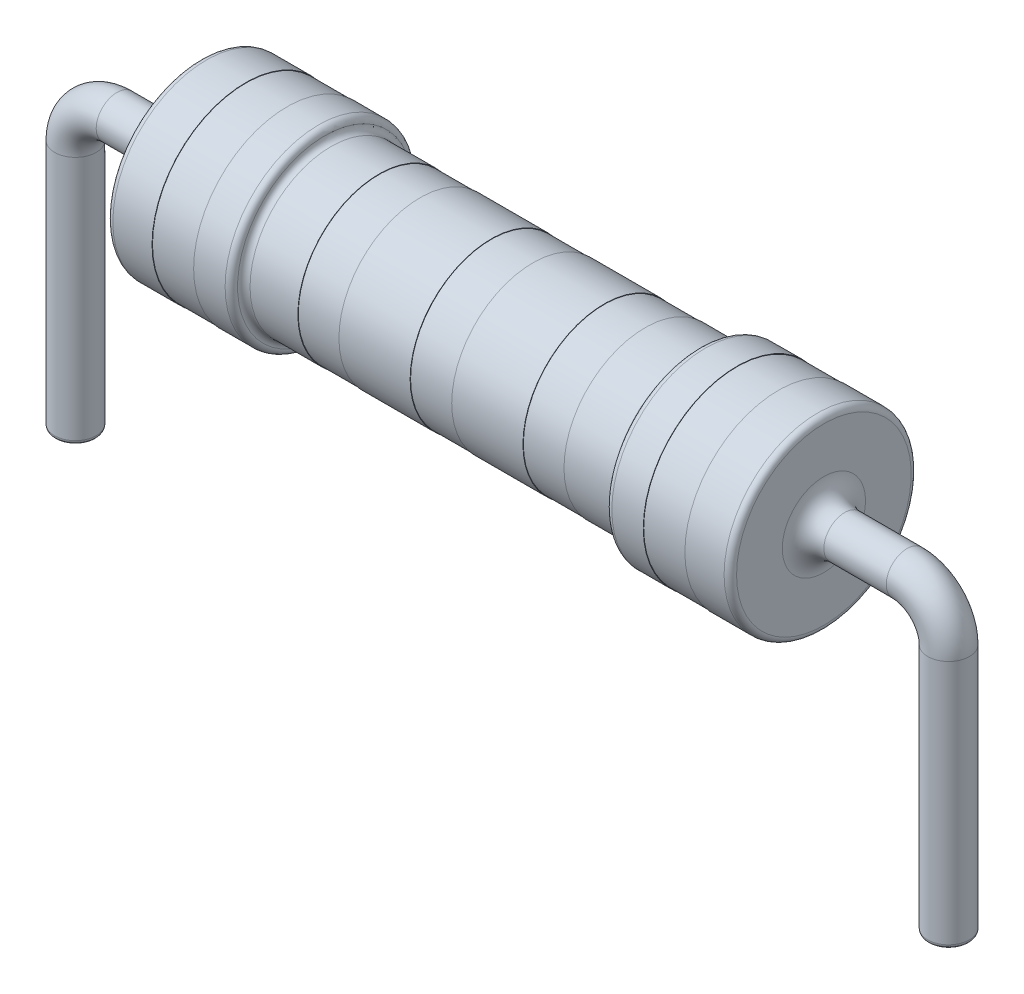
ISO-10303-21;
HEADER;
FILE_DESCRIPTION(('STEP AP214'),'2;1');
FILE_NAME('part.step','',(''),(''),'','','');
FILE_SCHEMA(('AUTOMOTIVE_DESIGN { 1 0 10303 214 1 1 1 1 }'));
ENDSEC;
DATA;
#1=APPLICATION_CONTEXT('core data for automotive mechanical design processes');
#2=APPLICATION_PROTOCOL_DEFINITION('international standard','automotive_design',2000,#1);
#3=PRODUCT_CONTEXT('',#1,'mechanical');
#4=PRODUCT('Part','Part','',(#3));
#5=PRODUCT_RELATED_PRODUCT_CATEGORY('part','',(#4));
#6=PRODUCT_DEFINITION_FORMATION('','',#4);
#7=PRODUCT_DEFINITION_CONTEXT('part definition',#1,'design');
#8=PRODUCT_DEFINITION('design','',#6,#7);
#9=PRODUCT_DEFINITION_SHAPE('','',#8);
#10=(LENGTH_UNIT() NAMED_UNIT(*) SI_UNIT(.MILLI.,.METRE.));
#11=(NAMED_UNIT(*) PLANE_ANGLE_UNIT() SI_UNIT($,.RADIAN.));
#12=(NAMED_UNIT(*) SI_UNIT($,.STERADIAN.) SOLID_ANGLE_UNIT());
#13=UNCERTAINTY_MEASURE_WITH_UNIT(LENGTH_MEASURE(1.E-05),#10,'distance_accuracy_value','');
#14=(GEOMETRIC_REPRESENTATION_CONTEXT(3) GLOBAL_UNCERTAINTY_ASSIGNED_CONTEXT((#13)) GLOBAL_UNIT_ASSIGNED_CONTEXT((#10,
#11,#12)) REPRESENTATION_CONTEXT('',''));
#15=CARTESIAN_POINT('',(0.,0.,0.));
#16=DIRECTION('',(0.,0.,1.));
#17=DIRECTION('',(1.,0.,0.));
#18=AXIS2_PLACEMENT_3D('',#15,#16,#17);
#19=CARTESIAN_POINT('',(7.5,-1.89738903908675,0.));
#20=DIRECTION('',(-1.,0.,0.));
#21=DIRECTION('',(0.,0.,1.));
#22=AXIS2_PLACEMENT_3D('',#19,#20,#21);
#23=PLANE('',#22);
#24=CARTESIAN_POINT('',(7.5,-1.89738903908675,0.));
#25=DIRECTION('',(-1.,0.,0.));
#26=DIRECTION('',(0.,0.,1.));
#27=AXIS2_PLACEMENT_3D('',#24,#25,#26);
#28=CIRCLE('',#27,1.);
#29=CARTESIAN_POINT('',(7.5,-1.89738903908675,1.));
#30=VERTEX_POINT('',#29);
#31=EDGE_CURVE('E10',#30,#30,#28,.T.);
#32=ORIENTED_EDGE('',*,*,#31,.T.);
#33=EDGE_LOOP('',(#32));
#34=FACE_BOUND('',#33,.T.);
#35=CARTESIAN_POINT('',(7.5,-1.89738903908675,0.));
#36=DIRECTION('',(-1.,0.,0.));
#37=DIRECTION('',(0.,0.,1.));
#38=AXIS2_PLACEMENT_3D('',#35,#36,#37);
#39=CIRCLE('',#38,2.1);
#40=CARTESIAN_POINT('',(7.5,-1.89738903908675,2.1));
#41=VERTEX_POINT('',#40);
#42=EDGE_CURVE('E60',#41,#41,#39,.F.);
#43=ORIENTED_EDGE('',*,*,#42,.T.);
#44=EDGE_LOOP('',(#43));
#45=FACE_BOUND('',#44,.T.);
#46=ADVANCED_FACE('F34',(#34,#45),#23,.F.);
#47=CARTESIAN_POINT('',(-7.5,-1.89738903908675,0.));
#48=DIRECTION('',(-1.,0.,0.));
#49=DIRECTION('',(0.,0.,1.));
#50=AXIS2_PLACEMENT_3D('',#47,#48,#49);
#51=CYLINDRICAL_SURFACE('',#50,2.25);
#52=CARTESIAN_POINT('',(-7.35,-1.89738903908675,0.));
#53=DIRECTION('',(-1.,0.,0.));
#54=DIRECTION('',(0.,0.,1.));
#55=AXIS2_PLACEMENT_3D('',#52,#53,#54);
#56=CIRCLE('',#55,2.25);
#57=CARTESIAN_POINT('',(-7.35,-1.89738903908675,2.25));
#58=VERTEX_POINT('',#57);
#59=EDGE_CURVE('E66',#58,#58,#56,.F.);
#60=ORIENTED_EDGE('',*,*,#59,.T.);
#61=EDGE_LOOP('',(#60));
#62=FACE_BOUND('',#61,.T.);
#63=CARTESIAN_POINT('',(-6.40684922175231,-1.89738903908675,0.));
#64=DIRECTION('',(-1.,0.,0.));
#65=DIRECTION('',(0.,0.,1.));
#66=AXIS2_PLACEMENT_3D('',#63,#64,#65);
#67=CIRCLE('',#66,2.25);
#68=CARTESIAN_POINT('',(-6.40684922175231,-1.89738903908675,2.25));
#69=VERTEX_POINT('',#68);
#70=EDGE_CURVE('E96',#69,#69,#67,.T.);
#71=ORIENTED_EDGE('',*,*,#70,.T.);
#72=EDGE_LOOP('',(#71));
#73=FACE_BOUND('',#72,.T.);
#74=ADVANCED_FACE('F189',(#62,#73),#51,.T.);
#75=CARTESIAN_POINT('',(-6.40684922175231,-4.14738903908675,0.));
#76=DIRECTION('',(1.,0.,0.));
#77=DIRECTION('',(0.,0.,-1.));
#78=AXIS2_PLACEMENT_3D('',#75,#76,#77);
#79=PLANE('',#78);
#80=CARTESIAN_POINT('',(-6.40684922175231,-1.89738903908675,0.));
#81=DIRECTION('',(-1.,0.,0.));
#82=DIRECTION('',(0.,0.,1.));
#83=AXIS2_PLACEMENT_3D('',#80,#81,#82);
#84=CIRCLE('',#83,2.24);
#85=CARTESIAN_POINT('',(-6.40684922175231,-1.89738903908675,2.24));
#86=VERTEX_POINT('',#85);
#87=EDGE_CURVE('E99',#86,#86,#84,.T.);
#88=ORIENTED_EDGE('',*,*,#87,.T.);
#89=EDGE_LOOP('',(#88));
#90=FACE_BOUND('',#89,.T.);
#91=ORIENTED_EDGE('',*,*,#70,.F.);
#92=EDGE_LOOP('',(#91));
#93=FACE_BOUND('',#92,.T.);
#94=ADVANCED_FACE('F194',(#90,#93),#79,.T.);
#95=CARTESIAN_POINT('',(-7.5,-1.89738903908675,0.));
#96=DIRECTION('',(-1.,0.,0.));
#97=DIRECTION('',(0.,0.,1.));
#98=AXIS2_PLACEMENT_3D('',#95,#96,#97);
#99=CYLINDRICAL_SURFACE('',#98,2.24);
#100=CARTESIAN_POINT('',(-5.40684922175231,-1.89738903908675,0.));
#101=DIRECTION('',(-1.,0.,0.));
#102=DIRECTION('',(0.,0.,1.));
#103=AXIS2_PLACEMENT_3D('',#100,#101,#102);
#104=CIRCLE('',#103,2.24);
#105=CARTESIAN_POINT('',(-5.40684922175231,-1.89738903908675,2.24));
#106=VERTEX_POINT('',#105);
#107=EDGE_CURVE('E102',#106,#106,#104,.T.);
#108=ORIENTED_EDGE('',*,*,#107,.T.);
#109=EDGE_LOOP('',(#108));
#110=FACE_BOUND('',#109,.T.);
#111=ORIENTED_EDGE('',*,*,#87,.F.);
#112=EDGE_LOOP('',(#111));
#113=FACE_BOUND('',#112,.T.);
#114=ADVANCED_FACE('F281',(#110,#113),#99,.T.);
#115=CARTESIAN_POINT('',(-5.40684922175231,-4.13738903908675,0.));
#116=DIRECTION('',(-1.,0.,0.));
#117=DIRECTION('',(0.,0.,1.));
#118=AXIS2_PLACEMENT_3D('',#115,#116,#117);
#119=PLANE('',#118);
#120=CARTESIAN_POINT('',(-5.40684922175231,-1.89738903908675,0.));
#121=DIRECTION('',(-1.,0.,0.));
#122=DIRECTION('',(0.,0.,1.));
#123=AXIS2_PLACEMENT_3D('',#120,#121,#122);
#124=CIRCLE('',#123,2.24999999999999);
#125=CARTESIAN_POINT('',(-5.40684922175231,-1.89738903908675,2.24999999999999));
#126=VERTEX_POINT('',#125);
#127=EDGE_CURVE('E105',#126,#126,#124,.T.);
#128=ORIENTED_EDGE('',*,*,#127,.T.);
#129=EDGE_LOOP('',(#128));
#130=FACE_BOUND('',#129,.T.);
#131=ORIENTED_EDGE('',*,*,#107,.F.);
#132=EDGE_LOOP('',(#131));
#133=FACE_BOUND('',#132,.T.);
#134=ADVANCED_FACE('F277',(#130,#133),#119,.T.);
#135=CARTESIAN_POINT('',(-7.5,-1.89738903908675,0.));
#136=DIRECTION('',(-1.,0.,0.));
#137=DIRECTION('',(0.,0.,1.));
#138=AXIS2_PLACEMENT_3D('',#135,#136,#137);
#139=CYLINDRICAL_SURFACE('',#138,2.24999999999999);
#140=CARTESIAN_POINT('',(-4.65,-1.89738903908675,0.));
#141=DIRECTION('',(1.,0.,0.));
#142=DIRECTION('',(0.,0.,-1.));
#143=AXIS2_PLACEMENT_3D('',#140,#141,#142);
#144=CIRCLE('',#143,2.24999999999999);
#145=CARTESIAN_POINT('',(-4.65,-1.89738903908675,-2.24999999999999));
#146=VERTEX_POINT('',#145);
#147=EDGE_CURVE('E75',#146,#146,#144,.F.);
#148=ORIENTED_EDGE('',*,*,#147,.T.);
#149=EDGE_LOOP('',(#148));
#150=FACE_BOUND('',#149,.T.);
#151=ORIENTED_EDGE('',*,*,#127,.F.);
#152=EDGE_LOOP('',(#151));
#153=FACE_BOUND('',#152,.T.);
#154=ADVANCED_FACE('F273',(#150,#153),#139,.T.);
#155=CARTESIAN_POINT('',(-7.5,-1.89738903908675,0.));
#156=DIRECTION('',(-1.,0.,0.));
#157=DIRECTION('',(0.,0.,1.));
#158=AXIS2_PLACEMENT_3D('',#155,#156,#157);
#159=CYLINDRICAL_SURFACE('',#158,1.95);
#160=CARTESIAN_POINT('',(-4.35,-1.89738903908675,0.));
#161=DIRECTION('',(1.,0.,0.));
#162=DIRECTION('',(0.,0.,-1.));
#163=AXIS2_PLACEMENT_3D('',#160,#161,#162);
#164=CIRCLE('',#163,1.95);
#165=CARTESIAN_POINT('',(-4.35,-1.89738903908675,-1.95));
#166=VERTEX_POINT('',#165);
#167=EDGE_CURVE('E54',#166,#166,#164,.T.);
#168=ORIENTED_EDGE('',*,*,#167,.T.);
#169=EDGE_LOOP('',(#168));
#170=FACE_BOUND('',#169,.T.);
#171=CARTESIAN_POINT('',(-3.2,-1.89738903908675,0.));
#172=DIRECTION('',(-1.,0.,0.));
#173=DIRECTION('',(0.,0.,1.));
#174=AXIS2_PLACEMENT_3D('',#171,#172,#173);
#175=CIRCLE('',#174,1.95);
#176=CARTESIAN_POINT('',(-3.2,-1.89738903908675,1.95));
#177=VERTEX_POINT('',#176);
#178=EDGE_CURVE('E108',#177,#177,#175,.T.);
#179=ORIENTED_EDGE('',*,*,#178,.T.);
#180=EDGE_LOOP('',(#179));
#181=FACE_BOUND('',#180,.T.);
#182=ADVANCED_FACE('F269',(#170,#181),#159,.T.);
#183=CARTESIAN_POINT('',(-3.2,-3.84738903908675,0.));
#184=DIRECTION('',(1.,0.,0.));
#185=DIRECTION('',(0.,0.,-1.));
#186=AXIS2_PLACEMENT_3D('',#183,#184,#185);
#187=PLANE('',#186);
#188=CARTESIAN_POINT('',(-3.2,-1.89738903908675,0.));
#189=DIRECTION('',(-1.,0.,0.));
#190=DIRECTION('',(0.,0.,1.));
#191=AXIS2_PLACEMENT_3D('',#188,#189,#190);
#192=CIRCLE('',#191,1.94);
#193=CARTESIAN_POINT('',(-3.2,-1.89738903908675,1.94));
#194=VERTEX_POINT('',#193);
#195=EDGE_CURVE('E111',#194,#194,#192,.T.);
#196=ORIENTED_EDGE('',*,*,#195,.T.);
#197=EDGE_LOOP('',(#196));
#198=FACE_BOUND('',#197,.T.);
#199=ORIENTED_EDGE('',*,*,#178,.F.);
#200=EDGE_LOOP('',(#199));
#201=FACE_BOUND('',#200,.T.);
#202=ADVANCED_FACE('F265',(#198,#201),#187,.T.);
#203=CARTESIAN_POINT('',(-7.5,-1.89738903908675,0.));
#204=DIRECTION('',(-1.,0.,0.));
#205=DIRECTION('',(0.,0.,1.));
#206=AXIS2_PLACEMENT_3D('',#203,#204,#205);
#207=CYLINDRICAL_SURFACE('',#206,1.94);
#208=CARTESIAN_POINT('',(-2.21268048519063,-1.89738903908675,0.));
#209=DIRECTION('',(-1.,0.,0.));
#210=DIRECTION('',(0.,0.,1.));
#211=AXIS2_PLACEMENT_3D('',#208,#209,#210);
#212=CIRCLE('',#211,1.94);
#213=CARTESIAN_POINT('',(-2.21268048519063,-1.89738903908675,1.94));
#214=VERTEX_POINT('',#213);
#215=EDGE_CURVE('E114',#214,#214,#212,.T.);
#216=ORIENTED_EDGE('',*,*,#215,.T.);
#217=EDGE_LOOP('',(#216));
#218=FACE_BOUND('',#217,.T.);
#219=ORIENTED_EDGE('',*,*,#195,.F.);
#220=EDGE_LOOP('',(#219));
#221=FACE_BOUND('',#220,.T.);
#222=ADVANCED_FACE('F261',(#218,#221),#207,.T.);
#223=CARTESIAN_POINT('',(-2.21268048519063,-3.83738903908675,0.));
#224=DIRECTION('',(-1.,0.,0.));
#225=DIRECTION('',(0.,0.,1.));
#226=AXIS2_PLACEMENT_3D('',#223,#224,#225);
#227=PLANE('',#226);
#228=CARTESIAN_POINT('',(-2.21268048519063,-1.89738903908675,0.));
#229=DIRECTION('',(-1.,0.,0.));
#230=DIRECTION('',(0.,0.,1.));
#231=AXIS2_PLACEMENT_3D('',#228,#229,#230);
#232=CIRCLE('',#231,1.95);
#233=CARTESIAN_POINT('',(-2.21268048519063,-1.89738903908675,1.95));
#234=VERTEX_POINT('',#233);
#235=EDGE_CURVE('E117',#234,#234,#232,.T.);
#236=ORIENTED_EDGE('',*,*,#235,.T.);
#237=EDGE_LOOP('',(#236));
#238=FACE_BOUND('',#237,.T.);
#239=ORIENTED_EDGE('',*,*,#215,.F.);
#240=EDGE_LOOP('',(#239));
#241=FACE_BOUND('',#240,.T.);
#242=ADVANCED_FACE('F257',(#238,#241),#227,.T.);
#243=CARTESIAN_POINT('',(-7.5,-1.89738903908675,0.));
#244=DIRECTION('',(-1.,0.,0.));
#245=DIRECTION('',(0.,0.,1.));
#246=AXIS2_PLACEMENT_3D('',#243,#244,#245);
#247=CYLINDRICAL_SURFACE('',#246,1.95);
#248=CARTESIAN_POINT('',(-0.5,-1.89738903908675,0.));
#249=DIRECTION('',(-1.,0.,0.));
#250=DIRECTION('',(0.,0.,1.));
#251=AXIS2_PLACEMENT_3D('',#248,#249,#250);
#252=CIRCLE('',#251,1.95);
#253=CARTESIAN_POINT('',(-0.5,-1.89738903908675,1.95));
#254=VERTEX_POINT('',#253);
#255=EDGE_CURVE('E120',#254,#254,#252,.T.);
#256=ORIENTED_EDGE('',*,*,#255,.T.);
#257=EDGE_LOOP('',(#256));
#258=FACE_BOUND('',#257,.T.);
#259=ORIENTED_EDGE('',*,*,#235,.F.);
#260=EDGE_LOOP('',(#259));
#261=FACE_BOUND('',#260,.T.);
#262=ADVANCED_FACE('F253',(#258,#261),#247,.T.);
#263=CARTESIAN_POINT('',(-0.5,-3.84738903908675,0.));
#264=DIRECTION('',(1.,0.,0.));
#265=DIRECTION('',(0.,0.,-1.));
#266=AXIS2_PLACEMENT_3D('',#263,#264,#265);
#267=PLANE('',#266);
#268=CARTESIAN_POINT('',(-0.5,-1.89738903908675,0.));
#269=DIRECTION('',(-1.,0.,0.));
#270=DIRECTION('',(0.,0.,1.));
#271=AXIS2_PLACEMENT_3D('',#268,#269,#270);
#272=CIRCLE('',#271,1.94);
#273=CARTESIAN_POINT('',(-0.5,-1.89738903908675,1.94));
#274=VERTEX_POINT('',#273);
#275=EDGE_CURVE('E123',#274,#274,#272,.T.);
#276=ORIENTED_EDGE('',*,*,#275,.T.);
#277=EDGE_LOOP('',(#276));
#278=FACE_BOUND('',#277,.T.);
#279=ORIENTED_EDGE('',*,*,#255,.F.);
#280=EDGE_LOOP('',(#279));
#281=FACE_BOUND('',#280,.T.);
#282=ADVANCED_FACE('F249',(#278,#281),#267,.T.);
#283=CARTESIAN_POINT('',(-7.5,-1.89738903908675,0.));
#284=DIRECTION('',(-1.,0.,0.));
#285=DIRECTION('',(0.,0.,1.));
#286=AXIS2_PLACEMENT_3D('',#283,#284,#285);
#287=CYLINDRICAL_SURFACE('',#286,1.94);
#288=ORIENTED_EDGE('',*,*,#275,.F.);
#289=EDGE_LOOP('',(#288));
#290=FACE_BOUND('',#289,.T.);
#291=CARTESIAN_POINT('',(0.5,-1.89738903908675,0.));
#292=DIRECTION('',(-1.,0.,0.));
#293=DIRECTION('',(0.,0.,1.));
#294=AXIS2_PLACEMENT_3D('',#291,#292,#293);
#295=CIRCLE('',#294,1.94);
#296=CARTESIAN_POINT('',(0.5,-1.89738903908675,1.94));
#297=VERTEX_POINT('',#296);
#298=EDGE_CURVE('E126',#297,#297,#295,.T.);
#299=ORIENTED_EDGE('',*,*,#298,.T.);
#300=EDGE_LOOP('',(#299));
#301=FACE_BOUND('',#300,.T.);
#302=ADVANCED_FACE('F245',(#290,#301),#287,.T.);
#303=CARTESIAN_POINT('',(0.5,-3.84738903908675,0.));
#304=DIRECTION('',(1.,0.,0.));
#305=DIRECTION('',(0.,0.,-1.));
#306=AXIS2_PLACEMENT_3D('',#303,#304,#305);
#307=PLANE('',#306);
#308=ORIENTED_EDGE('',*,*,#298,.F.);
#309=EDGE_LOOP('',(#308));
#310=FACE_BOUND('',#309,.T.);
#311=CARTESIAN_POINT('',(0.5,-1.89738903908675,0.));
#312=DIRECTION('',(-1.,0.,0.));
#313=DIRECTION('',(0.,0.,1.));
#314=AXIS2_PLACEMENT_3D('',#311,#312,#313);
#315=CIRCLE('',#314,1.95);
#316=CARTESIAN_POINT('',(0.5,-1.89738903908675,1.95));
#317=VERTEX_POINT('',#316);
#318=EDGE_CURVE('E129',#317,#317,#315,.T.);
#319=ORIENTED_EDGE('',*,*,#318,.T.);
#320=EDGE_LOOP('',(#319));
#321=FACE_BOUND('',#320,.T.);
#322=ADVANCED_FACE('F241',(#310,#321),#307,.F.);
#323=CARTESIAN_POINT('',(-7.5,-1.89738903908675,0.));
#324=DIRECTION('',(-1.,0.,0.));
#325=DIRECTION('',(0.,0.,1.));
#326=AXIS2_PLACEMENT_3D('',#323,#324,#325);
#327=CYLINDRICAL_SURFACE('',#326,1.95);
#328=ORIENTED_EDGE('',*,*,#318,.F.);
#329=EDGE_LOOP('',(#328));
#330=FACE_BOUND('',#329,.T.);
#331=CARTESIAN_POINT('',(2.21268048519063,-1.89738903908675,0.));
#332=DIRECTION('',(-1.,0.,0.));
#333=DIRECTION('',(0.,0.,1.));
#334=AXIS2_PLACEMENT_3D('',#331,#332,#333);
#335=CIRCLE('',#334,1.95);
#336=CARTESIAN_POINT('',(2.21268048519063,-1.89738903908675,1.95));
#337=VERTEX_POINT('',#336);
#338=EDGE_CURVE('E132',#337,#337,#335,.T.);
#339=ORIENTED_EDGE('',*,*,#338,.T.);
#340=EDGE_LOOP('',(#339));
#341=FACE_BOUND('',#340,.T.);
#342=ADVANCED_FACE('F237',(#330,#341),#327,.T.);
#343=CARTESIAN_POINT('',(2.21268048519063,-3.83738903908675,0.));
#344=DIRECTION('',(-1.,0.,0.));
#345=DIRECTION('',(0.,0.,1.));
#346=AXIS2_PLACEMENT_3D('',#343,#344,#345);
#347=PLANE('',#346);
#348=ORIENTED_EDGE('',*,*,#338,.F.);
#349=EDGE_LOOP('',(#348));
#350=FACE_BOUND('',#349,.T.);
#351=CARTESIAN_POINT('',(2.21268048519063,-1.89738903908675,0.));
#352=DIRECTION('',(-1.,0.,0.));
#353=DIRECTION('',(0.,0.,1.));
#354=AXIS2_PLACEMENT_3D('',#351,#352,#353);
#355=CIRCLE('',#354,1.94);
#356=CARTESIAN_POINT('',(2.21268048519063,-1.89738903908675,1.94));
#357=VERTEX_POINT('',#356);
#358=EDGE_CURVE('E135',#357,#357,#355,.T.);
#359=ORIENTED_EDGE('',*,*,#358,.T.);
#360=EDGE_LOOP('',(#359));
#361=FACE_BOUND('',#360,.T.);
#362=ADVANCED_FACE('F233',(#350,#361),#347,.F.);
#363=CARTESIAN_POINT('',(-7.5,-1.89738903908675,0.));
#364=DIRECTION('',(-1.,0.,0.));
#365=DIRECTION('',(0.,0.,1.));
#366=AXIS2_PLACEMENT_3D('',#363,#364,#365);
#367=CYLINDRICAL_SURFACE('',#366,1.94);
#368=ORIENTED_EDGE('',*,*,#358,.F.);
#369=EDGE_LOOP('',(#368));
#370=FACE_BOUND('',#369,.T.);
#371=CARTESIAN_POINT('',(3.2,-1.89738903908675,0.));
#372=DIRECTION('',(-1.,0.,0.));
#373=DIRECTION('',(0.,0.,1.));
#374=AXIS2_PLACEMENT_3D('',#371,#372,#373);
#375=CIRCLE('',#374,1.94);
#376=CARTESIAN_POINT('',(3.2,-1.89738903908675,1.94));
#377=VERTEX_POINT('',#376);
#378=EDGE_CURVE('E138',#377,#377,#375,.T.);
#379=ORIENTED_EDGE('',*,*,#378,.T.);
#380=EDGE_LOOP('',(#379));
#381=FACE_BOUND('',#380,.T.);
#382=ADVANCED_FACE('F229',(#370,#381),#367,.T.);
#383=CARTESIAN_POINT('',(3.2,-3.84738903908675,0.));
#384=DIRECTION('',(1.,0.,0.));
#385=DIRECTION('',(0.,0.,-1.));
#386=AXIS2_PLACEMENT_3D('',#383,#384,#385);
#387=PLANE('',#386);
#388=ORIENTED_EDGE('',*,*,#378,.F.);
#389=EDGE_LOOP('',(#388));
#390=FACE_BOUND('',#389,.T.);
#391=CARTESIAN_POINT('',(3.2,-1.89738903908675,0.));
#392=DIRECTION('',(-1.,0.,0.));
#393=DIRECTION('',(0.,0.,1.));
#394=AXIS2_PLACEMENT_3D('',#391,#392,#393);
#395=CIRCLE('',#394,1.95);
#396=CARTESIAN_POINT('',(3.2,-1.89738903908675,1.95));
#397=VERTEX_POINT('',#396);
#398=EDGE_CURVE('E141',#397,#397,#395,.T.);
#399=ORIENTED_EDGE('',*,*,#398,.T.);
#400=EDGE_LOOP('',(#399));
#401=FACE_BOUND('',#400,.T.);
#402=ADVANCED_FACE('F225',(#390,#401),#387,.F.);
#403=CARTESIAN_POINT('',(-7.5,-1.89738903908675,0.));
#404=DIRECTION('',(-1.,0.,0.));
#405=DIRECTION('',(0.,0.,1.));
#406=AXIS2_PLACEMENT_3D('',#403,#404,#405);
#407=CYLINDRICAL_SURFACE('',#406,1.95);
#408=CARTESIAN_POINT('',(4.35,-1.89738903908675,0.));
#409=DIRECTION('',(1.,0.,0.));
#410=DIRECTION('',(0.,0.,-1.));
#411=AXIS2_PLACEMENT_3D('',#408,#409,#410);
#412=CIRCLE('',#411,1.95);
#413=CARTESIAN_POINT('',(4.35,-1.89738903908675,-1.95));
#414=VERTEX_POINT('',#413);
#415=EDGE_CURVE('E57',#414,#414,#412,.F.);
#416=ORIENTED_EDGE('',*,*,#415,.T.);
#417=EDGE_LOOP('',(#416));
#418=FACE_BOUND('',#417,.T.);
#419=ORIENTED_EDGE('',*,*,#398,.F.);
#420=EDGE_LOOP('',(#419));
#421=FACE_BOUND('',#420,.T.);
#422=ADVANCED_FACE('F221',(#418,#421),#407,.T.);
#423=CARTESIAN_POINT('',(-7.5,-1.89738903908675,0.));
#424=DIRECTION('',(-1.,0.,0.));
#425=DIRECTION('',(0.,0.,1.));
#426=AXIS2_PLACEMENT_3D('',#423,#424,#425);
#427=CYLINDRICAL_SURFACE('',#426,2.25);
#428=CARTESIAN_POINT('',(4.65,-1.89738903908675,0.));
#429=DIRECTION('',(1.,0.,0.));
#430=DIRECTION('',(0.,0.,-1.));
#431=AXIS2_PLACEMENT_3D('',#428,#429,#430);
#432=CIRCLE('',#431,2.25);
#433=CARTESIAN_POINT('',(4.65,-1.89738903908675,-2.25));
#434=VERTEX_POINT('',#433);
#435=EDGE_CURVE('E78',#434,#434,#432,.T.);
#436=ORIENTED_EDGE('',*,*,#435,.T.);
#437=EDGE_LOOP('',(#436));
#438=FACE_BOUND('',#437,.T.);
#439=CARTESIAN_POINT('',(5.40684922175231,-1.89738903908675,0.));
#440=DIRECTION('',(-1.,0.,0.));
#441=DIRECTION('',(0.,0.,1.));
#442=AXIS2_PLACEMENT_3D('',#439,#440,#441);
#443=CIRCLE('',#442,2.25);
#444=CARTESIAN_POINT('',(5.40684922175231,-1.89738903908675,2.25));
#445=VERTEX_POINT('',#444);
#446=EDGE_CURVE('E144',#445,#445,#443,.T.);
#447=ORIENTED_EDGE('',*,*,#446,.T.);
#448=EDGE_LOOP('',(#447));
#449=FACE_BOUND('',#448,.T.);
#450=ADVANCED_FACE('F217',(#438,#449),#427,.T.);
#451=CARTESIAN_POINT('',(5.40684922175231,-4.13738903908675,0.));
#452=DIRECTION('',(-1.,0.,0.));
#453=DIRECTION('',(0.,0.,1.));
#454=AXIS2_PLACEMENT_3D('',#451,#452,#453);
#455=PLANE('',#454);
#456=ORIENTED_EDGE('',*,*,#446,.F.);
#457=EDGE_LOOP('',(#456));
#458=FACE_BOUND('',#457,.T.);
#459=CARTESIAN_POINT('',(5.40684922175231,-1.89738903908675,0.));
#460=DIRECTION('',(-1.,0.,0.));
#461=DIRECTION('',(0.,0.,1.));
#462=AXIS2_PLACEMENT_3D('',#459,#460,#461);
#463=CIRCLE('',#462,2.24);
#464=CARTESIAN_POINT('',(5.40684922175231,-1.89738903908675,2.24));
#465=VERTEX_POINT('',#464);
#466=EDGE_CURVE('E147',#465,#465,#463,.T.);
#467=ORIENTED_EDGE('',*,*,#466,.T.);
#468=EDGE_LOOP('',(#467));
#469=FACE_BOUND('',#468,.T.);
#470=ADVANCED_FACE('F213',(#458,#469),#455,.F.);
#471=CARTESIAN_POINT('',(-7.5,-1.89738903908675,0.));
#472=DIRECTION('',(-1.,0.,0.));
#473=DIRECTION('',(0.,0.,1.));
#474=AXIS2_PLACEMENT_3D('',#471,#472,#473);
#475=CYLINDRICAL_SURFACE('',#474,2.24);
#476=ORIENTED_EDGE('',*,*,#466,.F.);
#477=EDGE_LOOP('',(#476));
#478=FACE_BOUND('',#477,.T.);
#479=CARTESIAN_POINT('',(6.40684922175231,-1.89738903908675,0.));
#480=DIRECTION('',(-1.,0.,0.));
#481=DIRECTION('',(0.,0.,1.));
#482=AXIS2_PLACEMENT_3D('',#479,#480,#481);
#483=CIRCLE('',#482,2.24);
#484=CARTESIAN_POINT('',(6.40684922175231,-1.89738903908675,2.24));
#485=VERTEX_POINT('',#484);
#486=EDGE_CURVE('E150',#485,#485,#483,.T.);
#487=ORIENTED_EDGE('',*,*,#486,.T.);
#488=EDGE_LOOP('',(#487));
#489=FACE_BOUND('',#488,.T.);
#490=ADVANCED_FACE('F209',(#478,#489),#475,.T.);
#491=CARTESIAN_POINT('',(6.40684922175231,-4.14738903908675,0.));
#492=DIRECTION('',(1.,0.,0.));
#493=DIRECTION('',(0.,0.,-1.));
#494=AXIS2_PLACEMENT_3D('',#491,#492,#493);
#495=PLANE('',#494);
#496=ORIENTED_EDGE('',*,*,#486,.F.);
#497=EDGE_LOOP('',(#496));
#498=FACE_BOUND('',#497,.T.);
#499=CARTESIAN_POINT('',(6.40684922175231,-1.89738903908675,0.));
#500=DIRECTION('',(-1.,0.,0.));
#501=DIRECTION('',(0.,0.,1.));
#502=AXIS2_PLACEMENT_3D('',#499,#500,#501);
#503=CIRCLE('',#502,2.25);
#504=CARTESIAN_POINT('',(6.40684922175231,-1.89738903908675,2.25));
#505=VERTEX_POINT('',#504);
#506=EDGE_CURVE('E153',#505,#505,#503,.T.);
#507=ORIENTED_EDGE('',*,*,#506,.T.);
#508=EDGE_LOOP('',(#507));
#509=FACE_BOUND('',#508,.T.);
#510=ADVANCED_FACE('F205',(#498,#509),#495,.F.);
#511=CARTESIAN_POINT('',(-7.5,-1.89738903908675,0.));
#512=DIRECTION('',(-1.,0.,0.));
#513=DIRECTION('',(0.,0.,1.));
#514=AXIS2_PLACEMENT_3D('',#511,#512,#513);
#515=CYLINDRICAL_SURFACE('',#514,2.25);
#516=CARTESIAN_POINT('',(7.35,-1.89738903908675,0.));
#517=DIRECTION('',(-1.,0.,0.));
#518=DIRECTION('',(0.,0.,1.));
#519=AXIS2_PLACEMENT_3D('',#516,#517,#518);
#520=CIRCLE('',#519,2.25);
#521=CARTESIAN_POINT('',(7.35,-1.89738903908675,2.25));
#522=VERTEX_POINT('',#521);
#523=EDGE_CURVE('E63',#522,#522,#520,.T.);
#524=ORIENTED_EDGE('',*,*,#523,.T.);
#525=EDGE_LOOP('',(#524));
#526=FACE_BOUND('',#525,.T.);
#527=ORIENTED_EDGE('',*,*,#506,.F.);
#528=EDGE_LOOP('',(#527));
#529=FACE_BOUND('',#528,.T.);
#530=ADVANCED_FACE('F202',(#526,#529),#515,.T.);
#531=CARTESIAN_POINT('',(-7.5,-1.89738903908675,0.));
#532=DIRECTION('',(-1.,0.,0.));
#533=DIRECTION('',(0.,0.,1.));
#534=AXIS2_PLACEMENT_3D('',#531,#532,#533);
#535=PLANE('',#534);
#536=CARTESIAN_POINT('',(-7.5,-1.89738903908675,0.));
#537=DIRECTION('',(-1.,0.,0.));
#538=DIRECTION('',(0.,0.,1.));
#539=AXIS2_PLACEMENT_3D('',#536,#537,#538);
#540=CIRCLE('',#539,1.);
#541=CARTESIAN_POINT('',(-7.5,-1.89738903908675,1.));
#542=VERTEX_POINT('',#541);
#543=EDGE_CURVE('E45',#542,#542,#540,.F.);
#544=ORIENTED_EDGE('',*,*,#543,.T.);
#545=EDGE_LOOP('',(#544));
#546=FACE_BOUND('',#545,.T.);
#547=CARTESIAN_POINT('',(-7.5,-1.89738903908675,0.));
#548=DIRECTION('',(-1.,0.,0.));
#549=DIRECTION('',(0.,0.,1.));
#550=AXIS2_PLACEMENT_3D('',#547,#548,#549);
#551=CIRCLE('',#550,2.1);
#552=CARTESIAN_POINT('',(-7.5,-1.89738903908675,2.1));
#553=VERTEX_POINT('',#552);
#554=EDGE_CURVE('E69',#553,#553,#551,.T.);
#555=ORIENTED_EDGE('',*,*,#554,.T.);
#556=EDGE_LOOP('',(#555));
#557=FACE_BOUND('',#556,.T.);
#558=ADVANCED_FACE('F200',(#546,#557),#535,.T.);
#559=CARTESIAN_POINT('',(10.5,-2.89738903908675,0.));
#560=DIRECTION('',(0.,-1.,0.));
#561=DIRECTION('',(0.,0.,-1.));
#562=AXIS2_PLACEMENT_3D('',#559,#560,#561);
#563=CYLINDRICAL_SURFACE('',#562,0.5);
#564=CARTESIAN_POINT('',(10.5,-8.79738903908675,0.));
#565=DIRECTION('',(0.,-1.,0.));
#566=DIRECTION('',(1.,0.,0.));
#567=AXIS2_PLACEMENT_3D('',#564,#565,#566);
#568=CIRCLE('',#567,0.5);
#569=CARTESIAN_POINT('',(11.,-8.79738903908675,0.));
#570=VERTEX_POINT('',#569);
#571=EDGE_CURVE('E84',#570,#570,#568,.F.);
#572=ORIENTED_EDGE('',*,*,#571,.T.);
#573=EDGE_LOOP('',(#572));
#574=FACE_BOUND('',#573,.T.);
#575=CARTESIAN_POINT('',(10.5,-2.89738903908675,0.));
#576=DIRECTION('',(0.,-1.,0.));
#577=DIRECTION('',(0.,0.,-1.));
#578=AXIS2_PLACEMENT_3D('',#575,#576,#577);
#579=CIRCLE('',#578,0.5);
#580=CARTESIAN_POINT('',(11.,-2.89738903908675,0.));
#581=VERTEX_POINT('',#580);
#582=EDGE_CURVE('E156',#581,#581,#579,.T.);
#583=ORIENTED_EDGE('',*,*,#582,.T.);
#584=EDGE_LOOP('',(#583));
#585=FACE_BOUND('',#584,.T.);
#586=ADVANCED_FACE('F397',(#574,#585),#563,.T.);
#587=CARTESIAN_POINT('',(9.5,-2.89738903908675,0.));
#588=DIRECTION('',(0.,0.,-1.));
#589=DIRECTION('',(-1.,0.,0.));
#590=AXIS2_PLACEMENT_3D('',#587,#588,#589);
#591=TOROIDAL_SURFACE('',#590,1.,0.5);
#592=CARTESIAN_POINT('',(9.5,-1.89738903908675,0.));
#593=DIRECTION('',(1.,0.,0.));
#594=DIRECTION('',(0.,0.,-1.));
#595=AXIS2_PLACEMENT_3D('',#592,#593,#594);
#596=CIRCLE('',#595,0.5);
#597=CARTESIAN_POINT('',(9.5,-1.39738903908675,0.));
#598=VERTEX_POINT('',#597);
#599=EDGE_CURVE('E159',#598,#598,#596,.T.);
#600=CARTESIAN_POINT('',(9.5,-2.89738903908675,0.));
#601=DIRECTION('',(0.,0.,-1.));
#602=DIRECTION('',(-1.,0.,0.));
#603=AXIS2_PLACEMENT_3D('',#600,#601,#602);
#604=CIRCLE('',#603,1.5);
#605=EDGE_CURVE('',#598,#581,#604,.T.);
#606=ORIENTED_EDGE('',*,*,#599,.T.);
#607=ORIENTED_EDGE('',*,*,#582,.F.);
#608=ORIENTED_EDGE('',*,*,#605,.T.);
#609=ORIENTED_EDGE('',*,*,#605,.F.);
#610=EDGE_LOOP('',(#606,#608,#607,#609));
#611=FACE_BOUND('',#610,.T.);
#612=ADVANCED_FACE('F409',(#611),#591,.T.);
#613=CARTESIAN_POINT('',(9.5,-1.89738903908675,0.));
#614=DIRECTION('',(-1.,0.,0.));
#615=DIRECTION('',(0.,0.,1.));
#616=AXIS2_PLACEMENT_3D('',#613,#614,#615);
#617=CYLINDRICAL_SURFACE('',#616,0.5);
#618=CARTESIAN_POINT('',(8.,-1.89738903908675,0.));
#619=DIRECTION('',(-1.,0.,0.));
#620=DIRECTION('',(0.,0.,1.));
#621=AXIS2_PLACEMENT_3D('',#618,#619,#620);
#622=CIRCLE('',#621,0.5);
#623=CARTESIAN_POINT('',(8.,-1.89738903908675,0.5));
#624=VERTEX_POINT('',#623);
#625=EDGE_CURVE('E41',#624,#624,#622,.F.);
#626=ORIENTED_EDGE('',*,*,#625,.T.);
#627=EDGE_LOOP('',(#626));
#628=FACE_BOUND('',#627,.T.);
#629=ORIENTED_EDGE('',*,*,#599,.F.);
#630=EDGE_LOOP('',(#629));
#631=FACE_BOUND('',#630,.T.);
#632=ADVANCED_FACE('F185',(#628,#631),#617,.T.);
#633=CARTESIAN_POINT('',(10.5,-8.89738903908675,0.));
#634=DIRECTION('',(0.,-1.,0.));
#635=DIRECTION('',(0.,0.,-1.));
#636=AXIS2_PLACEMENT_3D('',#633,#634,#635);
#637=PLANE('',#636);
#638=CARTESIAN_POINT('',(10.5,-8.89738903908675,0.));
#639=DIRECTION('',(0.,-1.,0.));
#640=DIRECTION('',(1.,0.,0.));
#641=AXIS2_PLACEMENT_3D('',#638,#639,#640);
#642=CIRCLE('',#641,0.4);
#643=CARTESIAN_POINT('',(10.9,-8.89738903908675,0.));
#644=VERTEX_POINT('',#643);
#645=EDGE_CURVE('E87',#644,#644,#642,.T.);
#646=ORIENTED_EDGE('',*,*,#645,.T.);
#647=EDGE_LOOP('',(#646));
#648=FACE_BOUND('',#647,.T.);
#649=ADVANCED_FACE('F179',(#648),#637,.T.);
#650=CARTESIAN_POINT('',(-10.5,-2.89738903908675,0.));
#651=DIRECTION('',(0.,-1.,0.));
#652=DIRECTION('',(0.,0.,-1.));
#653=AXIS2_PLACEMENT_3D('',#650,#651,#652);
#654=CYLINDRICAL_SURFACE('',#653,0.5);
#655=CARTESIAN_POINT('',(-10.5,-8.79738903908675,0.));
#656=DIRECTION('',(0.,-1.,0.));
#657=DIRECTION('',(1.,0.,0.));
#658=AXIS2_PLACEMENT_3D('',#655,#656,#657);
#659=CIRCLE('',#658,0.5);
#660=CARTESIAN_POINT('',(-10.,-8.79738903908675,0.));
#661=VERTEX_POINT('',#660);
#662=EDGE_CURVE('E93',#661,#661,#659,.F.);
#663=ORIENTED_EDGE('',*,*,#662,.T.);
#664=EDGE_LOOP('',(#663));
#665=FACE_BOUND('',#664,.T.);
#666=CARTESIAN_POINT('',(-10.5,-2.89738903908675,0.));
#667=DIRECTION('',(0.,1.,0.));
#668=DIRECTION('',(0.,0.,-1.));
#669=AXIS2_PLACEMENT_3D('',#666,#667,#668);
#670=CIRCLE('',#669,0.5);
#671=CARTESIAN_POINT('',(-11.,-2.89738903908675,0.));
#672=VERTEX_POINT('',#671);
#673=EDGE_CURVE('E162',#672,#672,#670,.T.);
#674=ORIENTED_EDGE('',*,*,#673,.F.);
#675=EDGE_LOOP('',(#674));
#676=FACE_BOUND('',#675,.T.);
#677=ADVANCED_FACE('F174',(#665,#676),#654,.T.);
#678=CARTESIAN_POINT('',(-9.5,-2.89738903908675,0.));
#679=DIRECTION('',(0.,0.,1.));
#680=DIRECTION('',(1.,0.,0.));
#681=AXIS2_PLACEMENT_3D('',#678,#679,#680);
#682=TOROIDAL_SURFACE('',#681,1.,0.5);
#683=CARTESIAN_POINT('',(-9.5,-1.89738903908675,0.));
#684=DIRECTION('',(1.,0.,0.));
#685=DIRECTION('',(0.,0.,-1.));
#686=AXIS2_PLACEMENT_3D('',#683,#684,#685);
#687=CIRCLE('',#686,0.5);
#688=CARTESIAN_POINT('',(-9.5,-1.39738903908675,0.));
#689=VERTEX_POINT('',#688);
#690=EDGE_CURVE('E165',#689,#689,#687,.T.);
#691=CARTESIAN_POINT('',(-9.5,-2.89738903908675,0.));
#692=DIRECTION('',(0.,0.,1.));
#693=DIRECTION('',(1.,0.,0.));
#694=AXIS2_PLACEMENT_3D('',#691,#692,#693);
#695=CIRCLE('',#694,1.5);
#696=EDGE_CURVE('',#689,#672,#695,.T.);
#697=ORIENTED_EDGE('',*,*,#690,.F.);
#698=ORIENTED_EDGE('',*,*,#673,.T.);
#699=ORIENTED_EDGE('',*,*,#696,.T.);
#700=ORIENTED_EDGE('',*,*,#696,.F.);
#701=EDGE_LOOP('',(#697,#699,#698,#700));
#702=FACE_BOUND('',#701,.T.);
#703=ADVANCED_FACE('F171',(#702),#682,.T.);
#704=CARTESIAN_POINT('',(-9.5,-1.89738903908675,0.));
#705=DIRECTION('',(1.,0.,0.));
#706=DIRECTION('',(0.,0.,-1.));
#707=AXIS2_PLACEMENT_3D('',#704,#705,#706);
#708=CYLINDRICAL_SURFACE('',#707,0.5);
#709=CARTESIAN_POINT('',(-8.,-1.89738903908675,0.));
#710=DIRECTION('',(-1.,0.,0.));
#711=DIRECTION('',(0.,0.,1.));
#712=AXIS2_PLACEMENT_3D('',#709,#710,#711);
#713=CIRCLE('',#712,0.5);
#714=CARTESIAN_POINT('',(-8.,-1.89738903908675,0.5));
#715=VERTEX_POINT('',#714);
#716=EDGE_CURVE('E49',#715,#715,#713,.T.);
#717=ORIENTED_EDGE('',*,*,#716,.T.);
#718=EDGE_LOOP('',(#717));
#719=FACE_BOUND('',#718,.T.);
#720=ORIENTED_EDGE('',*,*,#690,.T.);
#721=EDGE_LOOP('',(#720));
#722=FACE_BOUND('',#721,.T.);
#723=ADVANCED_FACE('F169',(#719,#722),#708,.T.);
#724=CARTESIAN_POINT('',(-10.5,-8.89738903908675,0.));
#725=DIRECTION('',(0.,-1.,0.));
#726=DIRECTION('',(0.,0.,-1.));
#727=AXIS2_PLACEMENT_3D('',#724,#725,#726);
#728=PLANE('',#727);
#729=CARTESIAN_POINT('',(-10.5,-8.89738903908675,0.));
#730=DIRECTION('',(0.,-1.,0.));
#731=DIRECTION('',(1.,0.,0.));
#732=AXIS2_PLACEMENT_3D('',#729,#730,#731);
#733=CIRCLE('',#732,0.4);
#734=CARTESIAN_POINT('',(-10.1,-8.89738903908675,0.));
#735=VERTEX_POINT('',#734);
#736=EDGE_CURVE('E90',#735,#735,#733,.T.);
#737=ORIENTED_EDGE('',*,*,#736,.T.);
#738=EDGE_LOOP('',(#737));
#739=FACE_BOUND('',#738,.T.);
#740=ADVANCED_FACE('F293',(#739),#728,.T.);
#741=CARTESIAN_POINT('',(-10.5,-8.79738903908675,0.));
#742=DIRECTION('',(0.,-1.,0.));
#743=DIRECTION('',(1.,0.,0.));
#744=AXIS2_PLACEMENT_3D('',#741,#742,#743);
#745=TOROIDAL_SURFACE('',#744,0.4,0.1);
#746=ORIENTED_EDGE('',*,*,#736,.F.);
#747=EDGE_LOOP('',(#746));
#748=FACE_BOUND('',#747,.T.);
#749=ORIENTED_EDGE('',*,*,#662,.F.);
#750=EDGE_LOOP('',(#749));
#751=FACE_BOUND('',#750,.T.);
#752=ADVANCED_FACE('F289',(#748,#751),#745,.T.);
#753=CARTESIAN_POINT('',(10.5,-8.79738903908675,0.));
#754=DIRECTION('',(0.,-1.,0.));
#755=DIRECTION('',(1.,0.,0.));
#756=AXIS2_PLACEMENT_3D('',#753,#754,#755);
#757=TOROIDAL_SURFACE('',#756,0.4,0.1);
#758=ORIENTED_EDGE('',*,*,#571,.F.);
#759=EDGE_LOOP('',(#758));
#760=FACE_BOUND('',#759,.T.);
#761=ORIENTED_EDGE('',*,*,#645,.F.);
#762=EDGE_LOOP('',(#761));
#763=FACE_BOUND('',#762,.T.);
#764=ADVANCED_FACE('F292',(#760,#763),#757,.T.);
#765=CARTESIAN_POINT('',(4.65,-1.89738903908675,0.));
#766=DIRECTION('',(1.,0.,0.));
#767=DIRECTION('',(0.,0.,-1.));
#768=AXIS2_PLACEMENT_3D('',#765,#766,#767);
#769=TOROIDAL_SURFACE('',#768,2.1,0.15);
#770=ORIENTED_EDGE('',*,*,#435,.F.);
#771=EDGE_LOOP('',(#770));
#772=FACE_BOUND('',#771,.T.);
#773=CARTESIAN_POINT('',(4.5,-1.89738903908675,0.));
#774=DIRECTION('',(1.,0.,0.));
#775=DIRECTION('',(0.,0.,-1.));
#776=AXIS2_PLACEMENT_3D('',#773,#774,#775);
#777=CIRCLE('',#776,2.1);
#778=CARTESIAN_POINT('',(4.5,-1.89738903908675,-2.1));
#779=VERTEX_POINT('',#778);
#780=EDGE_CURVE('E81',#779,#779,#777,.F.);
#781=ORIENTED_EDGE('',*,*,#780,.F.);
#782=EDGE_LOOP('',(#781));
#783=FACE_BOUND('',#782,.T.);
#784=ADVANCED_FACE('F297',(#772,#783),#769,.T.);
#785=CARTESIAN_POINT('',(-4.65,-1.89738903908675,0.));
#786=DIRECTION('',(1.,0.,0.));
#787=DIRECTION('',(0.,0.,-1.));
#788=AXIS2_PLACEMENT_3D('',#785,#786,#787);
#789=TOROIDAL_SURFACE('',#788,2.09999999999999,0.15);
#790=CARTESIAN_POINT('',(-4.5,-1.89738903908675,0.));
#791=DIRECTION('',(1.,0.,0.));
#792=DIRECTION('',(0.,0.,-1.));
#793=AXIS2_PLACEMENT_3D('',#790,#791,#792);
#794=CIRCLE('',#793,2.09999999999999);
#795=CARTESIAN_POINT('',(-4.5,-1.89738903908675,-2.09999999999999));
#796=VERTEX_POINT('',#795);
#797=EDGE_CURVE('E72',#796,#796,#794,.T.);
#798=ORIENTED_EDGE('',*,*,#797,.F.);
#799=EDGE_LOOP('',(#798));
#800=FACE_BOUND('',#799,.T.);
#801=ORIENTED_EDGE('',*,*,#147,.F.);
#802=EDGE_LOOP('',(#801));
#803=FACE_BOUND('',#802,.T.);
#804=ADVANCED_FACE('F301',(#800,#803),#789,.T.);
#805=CARTESIAN_POINT('',(-7.35,-1.89738903908675,0.));
#806=DIRECTION('',(-1.,0.,0.));
#807=DIRECTION('',(0.,0.,1.));
#808=AXIS2_PLACEMENT_3D('',#805,#806,#807);
#809=TOROIDAL_SURFACE('',#808,2.1,0.15);
#810=ORIENTED_EDGE('',*,*,#59,.F.);
#811=EDGE_LOOP('',(#810));
#812=FACE_BOUND('',#811,.T.);
#813=ORIENTED_EDGE('',*,*,#554,.F.);
#814=EDGE_LOOP('',(#813));
#815=FACE_BOUND('',#814,.T.);
#816=ADVANCED_FACE('F305',(#812,#815),#809,.T.);
#817=CARTESIAN_POINT('',(7.35,-1.89738903908675,0.));
#818=DIRECTION('',(-1.,0.,0.));
#819=DIRECTION('',(0.,0.,1.));
#820=AXIS2_PLACEMENT_3D('',#817,#818,#819);
#821=TOROIDAL_SURFACE('',#820,2.1,0.15);
#822=ORIENTED_EDGE('',*,*,#42,.F.);
#823=EDGE_LOOP('',(#822));
#824=FACE_BOUND('',#823,.T.);
#825=ORIENTED_EDGE('',*,*,#523,.F.);
#826=EDGE_LOOP('',(#825));
#827=FACE_BOUND('',#826,.T.);
#828=ADVANCED_FACE('F309',(#824,#827),#821,.T.);
#829=CARTESIAN_POINT('',(4.35,-1.89738903908675,0.));
#830=DIRECTION('',(1.,0.,0.));
#831=DIRECTION('',(0.,0.,-1.));
#832=AXIS2_PLACEMENT_3D('',#829,#830,#831);
#833=TOROIDAL_SURFACE('',#832,2.1,0.15);
#834=ORIENTED_EDGE('',*,*,#780,.T.);
#835=EDGE_LOOP('',(#834));
#836=FACE_BOUND('',#835,.T.);
#837=ORIENTED_EDGE('',*,*,#415,.F.);
#838=EDGE_LOOP('',(#837));
#839=FACE_BOUND('',#838,.T.);
#840=ADVANCED_FACE('F313',(#836,#839),#833,.F.);
#841=CARTESIAN_POINT('',(-4.35,-1.89738903908675,0.));
#842=DIRECTION('',(1.,0.,0.));
#843=DIRECTION('',(0.,0.,-1.));
#844=AXIS2_PLACEMENT_3D('',#841,#842,#843);
#845=TOROIDAL_SURFACE('',#844,2.1,0.15);
#846=ORIENTED_EDGE('',*,*,#167,.F.);
#847=EDGE_LOOP('',(#846));
#848=FACE_BOUND('',#847,.T.);
#849=ORIENTED_EDGE('',*,*,#797,.T.);
#850=EDGE_LOOP('',(#849));
#851=FACE_BOUND('',#850,.T.);
#852=ADVANCED_FACE('F317',(#848,#851),#845,.F.);
#853=CARTESIAN_POINT('',(-8.,-1.89738903908675,0.));
#854=DIRECTION('',(-1.,0.,0.));
#855=DIRECTION('',(0.,0.,1.));
#856=AXIS2_PLACEMENT_3D('',#853,#854,#855);
#857=TOROIDAL_SURFACE('',#856,1.,0.5);
#858=ORIENTED_EDGE('',*,*,#543,.F.);
#859=EDGE_LOOP('',(#858));
#860=FACE_BOUND('',#859,.T.);
#861=ORIENTED_EDGE('',*,*,#716,.F.);
#862=EDGE_LOOP('',(#861));
#863=FACE_BOUND('',#862,.T.);
#864=ADVANCED_FACE('F320',(#860,#863),#857,.F.);
#865=CARTESIAN_POINT('',(8.,-1.89738903908675,0.));
#866=DIRECTION('',(-1.,0.,0.));
#867=DIRECTION('',(0.,0.,1.));
#868=AXIS2_PLACEMENT_3D('',#865,#866,#867);
#869=TOROIDAL_SURFACE('',#868,1.,0.5);
#870=ORIENTED_EDGE('',*,*,#31,.F.);
#871=EDGE_LOOP('',(#870));
#872=FACE_BOUND('',#871,.T.);
#873=ORIENTED_EDGE('',*,*,#625,.F.);
#874=EDGE_LOOP('',(#873));
#875=FACE_BOUND('',#874,.T.);
#876=ADVANCED_FACE('F36',(#872,#875),#869,.F.);
#877=CLOSED_SHELL('',(#46,#74,#94,#114,#134,#154,#182,#202,#222,#242,#262,#282,#302,#322,#342,
#362,#382,#402,#422,#450,#470,#490,#510,#530,#558,#586,#612,#632,#649,#677,#703,#723,#740,#752,
#764,#784,#804,#816,#828,#840,#852,#864,#876));
#878=MANIFOLD_SOLID_BREP('B2',#877);
#879=ADVANCED_BREP_SHAPE_REPRESENTATION('',(#18,#878),#14);
#880=SHAPE_DEFINITION_REPRESENTATION(#9,#879);
ENDSEC;
END-ISO-10303-21;
